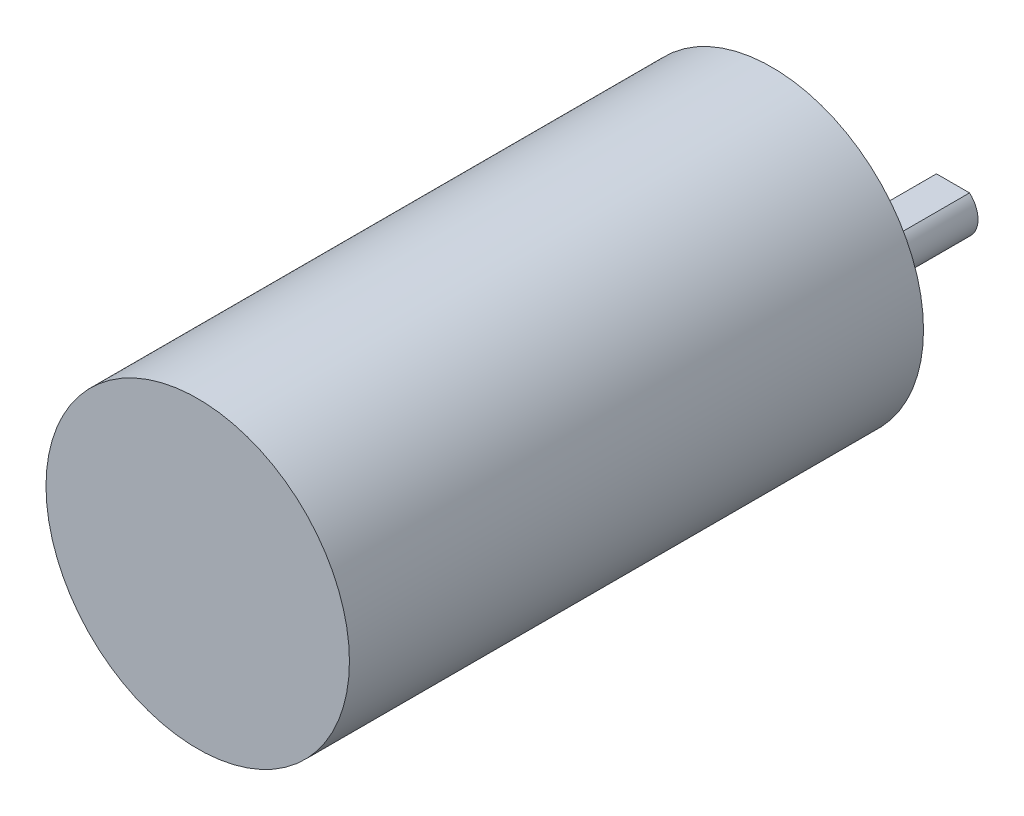
ISO-10303-21;
HEADER;
FILE_DESCRIPTION(('STEP AP214'),'2;1');
FILE_NAME('part.step','',(''),(''),'','','');
FILE_SCHEMA(('AUTOMOTIVE_DESIGN { 1 0 10303 214 1 1 1 1 }'));
ENDSEC;
DATA;
#1=APPLICATION_CONTEXT('core data for automotive mechanical design processes');
#2=APPLICATION_PROTOCOL_DEFINITION('international standard','automotive_design',2000,#1);
#3=PRODUCT_CONTEXT('',#1,'mechanical');
#4=PRODUCT('Part','Part','',(#3));
#5=PRODUCT_RELATED_PRODUCT_CATEGORY('part','',(#4));
#6=PRODUCT_DEFINITION_FORMATION('','',#4);
#7=PRODUCT_DEFINITION_CONTEXT('part definition',#1,'design');
#8=PRODUCT_DEFINITION('design','',#6,#7);
#9=PRODUCT_DEFINITION_SHAPE('','',#8);
#10=(LENGTH_UNIT() NAMED_UNIT(*) SI_UNIT(.MILLI.,.METRE.));
#11=(NAMED_UNIT(*) PLANE_ANGLE_UNIT() SI_UNIT($,.RADIAN.));
#12=(NAMED_UNIT(*) SI_UNIT($,.STERADIAN.) SOLID_ANGLE_UNIT());
#13=UNCERTAINTY_MEASURE_WITH_UNIT(LENGTH_MEASURE(1.E-05),#10,'distance_accuracy_value','');
#14=(GEOMETRIC_REPRESENTATION_CONTEXT(3) GLOBAL_UNCERTAINTY_ASSIGNED_CONTEXT((#13)) GLOBAL_UNIT_ASSIGNED_CONTEXT((#10,
#11,#12)) REPRESENTATION_CONTEXT('',''));
#15=CARTESIAN_POINT('',(0.,0.,0.));
#16=DIRECTION('',(0.,0.,1.));
#17=DIRECTION('',(1.,0.,0.));
#18=AXIS2_PLACEMENT_3D('',#15,#16,#17);
#19=CARTESIAN_POINT('',(0.,0.,70.));
#20=DIRECTION('',(0.,0.,-1.));
#21=DIRECTION('',(-1.,0.,0.));
#22=AXIS2_PLACEMENT_3D('',#19,#20,#21);
#23=CYLINDRICAL_SURFACE('',#22,18.5);
#24=CARTESIAN_POINT('',(0.,0.,70.));
#25=DIRECTION('',(0.,0.,1.));
#26=DIRECTION('',(1.,0.,0.));
#27=AXIS2_PLACEMENT_3D('',#24,#25,#26);
#28=CIRCLE('',#27,18.5);
#29=CARTESIAN_POINT('',(18.5,0.,70.));
#30=VERTEX_POINT('',#29);
#31=EDGE_CURVE('E85',#30,#30,#28,.T.);
#32=ORIENTED_EDGE('',*,*,#31,.F.);
#33=EDGE_LOOP('',(#32));
#34=FACE_BOUND('',#33,.T.);
#35=CARTESIAN_POINT('',(0.,0.,0.));
#36=DIRECTION('',(0.,0.,1.));
#37=DIRECTION('',(1.,0.,0.));
#38=AXIS2_PLACEMENT_3D('',#35,#36,#37);
#39=CIRCLE('',#38,18.5);
#40=CARTESIAN_POINT('',(18.5,0.,0.));
#41=VERTEX_POINT('',#40);
#42=EDGE_CURVE('E76',#41,#41,#39,.T.);
#43=ORIENTED_EDGE('',*,*,#42,.T.);
#44=EDGE_LOOP('',(#43));
#45=FACE_BOUND('',#44,.T.);
#46=ADVANCED_FACE('F34',(#34,#45),#23,.T.);
#47=CARTESIAN_POINT('',(0.,0.,70.));
#48=DIRECTION('',(0.,0.,1.));
#49=DIRECTION('',(1.,0.,0.));
#50=AXIS2_PLACEMENT_3D('',#47,#48,#49);
#51=PLANE('',#50);
#52=ORIENTED_EDGE('',*,*,#31,.T.);
#53=EDGE_LOOP('',(#52));
#54=FACE_BOUND('',#53,.T.);
#55=ADVANCED_FACE('F94',(#54),#51,.T.);
#56=CARTESIAN_POINT('',(0.,0.,0.));
#57=DIRECTION('',(0.,0.,1.));
#58=DIRECTION('',(1.,0.,0.));
#59=AXIS2_PLACEMENT_3D('',#56,#57,#58);
#60=PLANE('',#59);
#61=CARTESIAN_POINT('',(15.2766,0.,0.));
#62=DIRECTION('',(0.,0.,-1.));
#63=DIRECTION('',(-1.,0.,0.));
#64=AXIS2_PLACEMENT_3D('',#61,#62,#63);
#65=CIRCLE('',#64,1.6);
#66=CARTESIAN_POINT('',(13.6766,0.,0.));
#67=VERTEX_POINT('',#66);
#68=EDGE_CURVE('E79',#67,#67,#65,.T.);
#69=ORIENTED_EDGE('',*,*,#68,.F.);
#70=EDGE_LOOP('',(#69));
#71=FACE_BOUND('',#70,.T.);
#72=CARTESIAN_POINT('',(-7.79422931496333,13.2140965368011,0.));
#73=DIRECTION('',(0.,0.,-1.));
#74=DIRECTION('',(-1.,0.,0.));
#75=AXIS2_PLACEMENT_3D('',#72,#73,#74);
#76=CIRCLE('',#75,1.6);
#77=CARTESIAN_POINT('',(-9.39422931496333,13.2140965368011,0.));
#78=VERTEX_POINT('',#77);
#79=EDGE_CURVE('E292',#78,#78,#76,.T.);
#80=ORIENTED_EDGE('',*,*,#79,.F.);
#81=EDGE_LOOP('',(#80));
#82=FACE_BOUND('',#81,.T.);
#83=CARTESIAN_POINT('',(7.79422931496333,13.2140965368011,0.));
#84=DIRECTION('',(0.,0.,-1.));
#85=DIRECTION('',(-1.,0.,0.));
#86=AXIS2_PLACEMENT_3D('',#83,#84,#85);
#87=CIRCLE('',#86,1.6);
#88=CARTESIAN_POINT('',(6.19422931496333,13.2140965368011,0.));
#89=VERTEX_POINT('',#88);
#90=EDGE_CURVE('E82',#89,#89,#87,.T.);
#91=ORIENTED_EDGE('',*,*,#90,.F.);
#92=EDGE_LOOP('',(#91));
#93=FACE_BOUND('',#92,.T.);
#94=CARTESIAN_POINT('',(7.79422931496333,-13.5675408579338,0.));
#95=DIRECTION('',(0.,0.,-1.));
#96=DIRECTION('',(-1.,0.,0.));
#97=AXIS2_PLACEMENT_3D('',#94,#95,#96);
#98=CIRCLE('',#97,1.6);
#99=CARTESIAN_POINT('',(6.19422931496333,-13.5675408579338,0.));
#100=VERTEX_POINT('',#99);
#101=EDGE_CURVE('E318',#100,#100,#98,.T.);
#102=ORIENTED_EDGE('',*,*,#101,.F.);
#103=EDGE_LOOP('',(#102));
#104=FACE_BOUND('',#103,.T.);
#105=CARTESIAN_POINT('',(-7.79422931496334,-13.5675408579338,0.));
#106=DIRECTION('',(0.,0.,-1.));
#107=DIRECTION('',(-1.,0.,0.));
#108=AXIS2_PLACEMENT_3D('',#105,#106,#107);
#109=CIRCLE('',#108,1.6);
#110=CARTESIAN_POINT('',(-9.39422931496334,-13.5675408579338,0.));
#111=VERTEX_POINT('',#110);
#112=EDGE_CURVE('E312',#111,#111,#109,.T.);
#113=ORIENTED_EDGE('',*,*,#112,.F.);
#114=EDGE_LOOP('',(#113));
#115=FACE_BOUND('',#114,.T.);
#116=CARTESIAN_POINT('',(-15.2766,0.,0.));
#117=DIRECTION('',(0.,0.,-1.));
#118=DIRECTION('',(-1.,0.,0.));
#119=AXIS2_PLACEMENT_3D('',#116,#117,#118);
#120=CIRCLE('',#119,1.6);
#121=CARTESIAN_POINT('',(-16.8766,0.,0.));
#122=VERTEX_POINT('',#121);
#123=EDGE_CURVE('E306',#122,#122,#120,.T.);
#124=ORIENTED_EDGE('',*,*,#123,.F.);
#125=EDGE_LOOP('',(#124));
#126=FACE_BOUND('',#125,.T.);
#127=CARTESIAN_POINT('',(0.,-7.112,0.));
#128=DIRECTION('',(0.,0.,1.));
#129=DIRECTION('',(1.,0.,0.));
#130=AXIS2_PLACEMENT_3D('',#127,#128,#129);
#131=CIRCLE('',#130,5.969);
#132=CARTESIAN_POINT('',(5.969,-7.112,0.));
#133=VERTEX_POINT('',#132);
#134=EDGE_CURVE('E37',#133,#133,#131,.F.);
#135=ORIENTED_EDGE('',*,*,#134,.F.);
#136=EDGE_LOOP('',(#135));
#137=FACE_BOUND('',#136,.T.);
#138=ORIENTED_EDGE('',*,*,#42,.F.);
#139=EDGE_LOOP('',(#138));
#140=FACE_BOUND('',#139,.T.);
#141=ADVANCED_FACE('F91',(#71,#82,#93,#104,#115,#126,#137,#140),#60,.F.);
#142=CARTESIAN_POINT('',(0.,-7.112,-6.096));
#143=DIRECTION('',(0.,0.,1.));
#144=DIRECTION('',(1.,0.,0.));
#145=AXIS2_PLACEMENT_3D('',#142,#143,#144);
#146=CYLINDRICAL_SURFACE('',#145,5.969);
#147=CARTESIAN_POINT('',(0.,-7.112,-6.096));
#148=DIRECTION('',(0.,0.,-1.));
#149=DIRECTION('',(-1.,0.,0.));
#150=AXIS2_PLACEMENT_3D('',#147,#148,#149);
#151=CIRCLE('',#150,5.969);
#152=CARTESIAN_POINT('',(-5.969,-7.112,-6.096));
#153=VERTEX_POINT('',#152);
#154=EDGE_CURVE('E72',#153,#153,#151,.T.);
#155=ORIENTED_EDGE('',*,*,#154,.F.);
#156=EDGE_LOOP('',(#155));
#157=FACE_BOUND('',#156,.T.);
#158=ORIENTED_EDGE('',*,*,#134,.T.);
#159=EDGE_LOOP('',(#158));
#160=FACE_BOUND('',#159,.T.);
#161=ADVANCED_FACE('F93',(#157,#160),#146,.T.);
#162=CARTESIAN_POINT('',(0.,-7.112,-6.096));
#163=DIRECTION('',(0.,0.,-1.));
#164=DIRECTION('',(-1.,0.,0.));
#165=AXIS2_PLACEMENT_3D('',#162,#163,#164);
#166=PLANE('',#165);
#167=CARTESIAN_POINT('',(0.,-7.112,-6.096));
#168=DIRECTION('',(0.,0.,-1.));
#169=DIRECTION('',(-1.,0.,0.));
#170=AXIS2_PLACEMENT_3D('',#167,#168,#169);
#171=CIRCLE('',#170,3.048);
#172=CARTESIAN_POINT('',(2.01606249903122,-4.826,-6.096));
#173=VERTEX_POINT('',#172);
#174=CARTESIAN_POINT('',(-2.01606249903122,-4.826,-6.096));
#175=VERTEX_POINT('',#174);
#176=EDGE_CURVE('E11',#173,#175,#171,.T.);
#177=ORIENTED_EDGE('',*,*,#176,.F.);
#178=DIRECTION('',(1.,0.,0.));
#179=VECTOR('',#178,1.);
#180=CARTESIAN_POINT('',(2.01606249903122,-4.826,-6.096));
#181=LINE('',#180,#179);
#182=EDGE_CURVE('E54',#175,#173,#181,.T.);
#183=ORIENTED_EDGE('',*,*,#182,.F.);
#184=EDGE_LOOP('',(#177,#183));
#185=FACE_BOUND('',#184,.T.);
#186=ORIENTED_EDGE('',*,*,#154,.T.);
#187=EDGE_LOOP('',(#186));
#188=FACE_BOUND('',#187,.T.);
#189=ADVANCED_FACE('F100',(#185,#188),#166,.T.);
#190=CARTESIAN_POINT('',(0.,-7.112,-22.098));
#191=DIRECTION('',(0.,0.,1.));
#192=DIRECTION('',(1.,0.,0.));
#193=AXIS2_PLACEMENT_3D('',#190,#191,#192);
#194=CYLINDRICAL_SURFACE('',#193,3.048);
#195=CARTESIAN_POINT('',(0.,-7.112,-22.098));
#196=DIRECTION('',(0.,0.,-1.));
#197=DIRECTION('',(-1.,0.,0.));
#198=AXIS2_PLACEMENT_3D('',#195,#196,#197);
#199=CIRCLE('',#198,3.048);
#200=CARTESIAN_POINT('',(2.01606249903122,-4.826,-22.098));
#201=VERTEX_POINT('',#200);
#202=CARTESIAN_POINT('',(-2.01606249903122,-4.826,-22.098));
#203=VERTEX_POINT('',#202);
#204=EDGE_CURVE('E68',#201,#203,#199,.T.);
#205=ORIENTED_EDGE('',*,*,#204,.F.);
#206=DIRECTION('',(0.,0.,-1.));
#207=VECTOR('',#206,1.);
#208=CARTESIAN_POINT('',(2.01606249903122,-4.826,-1.99250441696351));
#209=LINE('',#208,#207);
#210=EDGE_CURVE('E49',#173,#201,#209,.T.);
#211=ORIENTED_EDGE('',*,*,#210,.F.);
#212=ORIENTED_EDGE('',*,*,#176,.T.);
#213=DIRECTION('',(0.,0.,-1.));
#214=VECTOR('',#213,1.);
#215=CARTESIAN_POINT('',(-2.01606249903122,-4.826,-1.99250441696351));
#216=LINE('',#215,#214);
#217=EDGE_CURVE('E61',#175,#203,#216,.T.);
#218=ORIENTED_EDGE('',*,*,#217,.T.);
#219=EDGE_LOOP('',(#205,#211,#212,#218));
#220=FACE_BOUND('',#219,.T.);
#221=ADVANCED_FACE('F67',(#220),#194,.T.);
#222=CARTESIAN_POINT('',(0.,-7.112,-22.098));
#223=DIRECTION('',(0.,0.,-1.));
#224=DIRECTION('',(-1.,0.,0.));
#225=AXIS2_PLACEMENT_3D('',#222,#223,#224);
#226=PLANE('',#225);
#227=DIRECTION('',(-1.,0.,0.));
#228=VECTOR('',#227,1.);
#229=CARTESIAN_POINT('',(2.01606249903122,-4.826,-22.098));
#230=LINE('',#229,#228);
#231=EDGE_CURVE('E58',#201,#203,#230,.T.);
#232=ORIENTED_EDGE('',*,*,#231,.F.);
#233=ORIENTED_EDGE('',*,*,#204,.T.);
#234=EDGE_LOOP('',(#232,#233));
#235=FACE_BOUND('',#234,.T.);
#236=ADVANCED_FACE('F71',(#235),#226,.T.);
#237=CARTESIAN_POINT('',(-15.2766,0.,3.));
#238=DIRECTION('',(0.,0.,-1.));
#239=DIRECTION('',(-1.,0.,0.));
#240=AXIS2_PLACEMENT_3D('',#237,#238,#239);
#241=CYLINDRICAL_SURFACE('',#240,1.6);
#242=CARTESIAN_POINT('',(-15.2766,0.,3.));
#243=DIRECTION('',(0.,0.,-1.));
#244=DIRECTION('',(-1.,0.,0.));
#245=AXIS2_PLACEMENT_3D('',#242,#243,#244);
#246=CIRCLE('',#245,1.6);
#247=CARTESIAN_POINT('',(-16.8766,0.,3.));
#248=VERTEX_POINT('',#247);
#249=EDGE_CURVE('E301',#248,#248,#246,.T.);
#250=ORIENTED_EDGE('',*,*,#249,.F.);
#251=EDGE_LOOP('',(#250));
#252=FACE_BOUND('',#251,.T.);
#253=ORIENTED_EDGE('',*,*,#123,.T.);
#254=EDGE_LOOP('',(#253));
#255=FACE_BOUND('',#254,.T.);
#256=ADVANCED_FACE('F133',(#252,#255),#241,.F.);
#257=CARTESIAN_POINT('',(-15.2766,0.,3.));
#258=DIRECTION('',(0.,0.,-1.));
#259=DIRECTION('',(-1.,0.,0.));
#260=AXIS2_PLACEMENT_3D('',#257,#258,#259);
#261=PLANE('',#260);
#262=ORIENTED_EDGE('',*,*,#249,.T.);
#263=EDGE_LOOP('',(#262));
#264=FACE_BOUND('',#263,.T.);
#265=ADVANCED_FACE('F138',(#264),#261,.T.);
#266=CARTESIAN_POINT('',(-7.79422931496334,-13.5675408579338,3.));
#267=DIRECTION('',(0.,0.,-1.));
#268=DIRECTION('',(-1.,0.,0.));
#269=AXIS2_PLACEMENT_3D('',#266,#267,#268);
#270=CYLINDRICAL_SURFACE('',#269,1.6);
#271=CARTESIAN_POINT('',(-7.79422931496334,-13.5675408579338,3.));
#272=DIRECTION('',(0.,0.,-1.));
#273=DIRECTION('',(-1.,0.,0.));
#274=AXIS2_PLACEMENT_3D('',#271,#272,#273);
#275=CIRCLE('',#274,1.6);
#276=CARTESIAN_POINT('',(-9.39422931496334,-13.5675408579338,3.));
#277=VERTEX_POINT('',#276);
#278=EDGE_CURVE('E309',#277,#277,#275,.T.);
#279=ORIENTED_EDGE('',*,*,#278,.F.);
#280=EDGE_LOOP('',(#279));
#281=FACE_BOUND('',#280,.T.);
#282=ORIENTED_EDGE('',*,*,#112,.T.);
#283=EDGE_LOOP('',(#282));
#284=FACE_BOUND('',#283,.T.);
#285=ADVANCED_FACE('F150',(#281,#284),#270,.F.);
#286=CARTESIAN_POINT('',(-7.79422931496334,-13.5675408579338,3.));
#287=DIRECTION('',(0.,0.,-1.));
#288=DIRECTION('',(-1.,0.,0.));
#289=AXIS2_PLACEMENT_3D('',#286,#287,#288);
#290=PLANE('',#289);
#291=ORIENTED_EDGE('',*,*,#278,.T.);
#292=EDGE_LOOP('',(#291));
#293=FACE_BOUND('',#292,.T.);
#294=ADVANCED_FACE('F160',(#293),#290,.T.);
#295=CARTESIAN_POINT('',(7.79422931496333,-13.5675408579338,3.));
#296=DIRECTION('',(0.,0.,-1.));
#297=DIRECTION('',(-1.,0.,0.));
#298=AXIS2_PLACEMENT_3D('',#295,#296,#297);
#299=CYLINDRICAL_SURFACE('',#298,1.6);
#300=CARTESIAN_POINT('',(7.79422931496333,-13.5675408579338,3.));
#301=DIRECTION('',(0.,0.,-1.));
#302=DIRECTION('',(-1.,0.,0.));
#303=AXIS2_PLACEMENT_3D('',#300,#301,#302);
#304=CIRCLE('',#303,1.6);
#305=CARTESIAN_POINT('',(6.19422931496333,-13.5675408579338,3.));
#306=VERTEX_POINT('',#305);
#307=EDGE_CURVE('E315',#306,#306,#304,.T.);
#308=ORIENTED_EDGE('',*,*,#307,.F.);
#309=EDGE_LOOP('',(#308));
#310=FACE_BOUND('',#309,.T.);
#311=ORIENTED_EDGE('',*,*,#101,.T.);
#312=EDGE_LOOP('',(#311));
#313=FACE_BOUND('',#312,.T.);
#314=ADVANCED_FACE('F170',(#310,#313),#299,.F.);
#315=CARTESIAN_POINT('',(7.79422931496333,-13.5675408579338,3.));
#316=DIRECTION('',(0.,0.,-1.));
#317=DIRECTION('',(-1.,0.,0.));
#318=AXIS2_PLACEMENT_3D('',#315,#316,#317);
#319=PLANE('',#318);
#320=ORIENTED_EDGE('',*,*,#307,.T.);
#321=EDGE_LOOP('',(#320));
#322=FACE_BOUND('',#321,.T.);
#323=ADVANCED_FACE('F180',(#322),#319,.T.);
#324=CARTESIAN_POINT('',(7.79422931496333,13.2140965368011,3.));
#325=DIRECTION('',(0.,0.,-1.));
#326=DIRECTION('',(-1.,0.,0.));
#327=AXIS2_PLACEMENT_3D('',#324,#325,#326);
#328=CYLINDRICAL_SURFACE('',#327,1.6);
#329=CARTESIAN_POINT('',(7.79422931496333,13.2140965368011,3.));
#330=DIRECTION('',(0.,0.,-1.));
#331=DIRECTION('',(-1.,0.,0.));
#332=AXIS2_PLACEMENT_3D('',#329,#330,#331);
#333=CIRCLE('',#332,1.6);
#334=CARTESIAN_POINT('',(6.19422931496333,13.2140965368011,3.));
#335=VERTEX_POINT('',#334);
#336=EDGE_CURVE('E320',#335,#335,#333,.T.);
#337=ORIENTED_EDGE('',*,*,#336,.F.);
#338=EDGE_LOOP('',(#337));
#339=FACE_BOUND('',#338,.T.);
#340=ORIENTED_EDGE('',*,*,#90,.T.);
#341=EDGE_LOOP('',(#340));
#342=FACE_BOUND('',#341,.T.);
#343=ADVANCED_FACE('F190',(#339,#342),#328,.F.);
#344=CARTESIAN_POINT('',(7.79422931496333,13.2140965368011,3.));
#345=DIRECTION('',(0.,0.,-1.));
#346=DIRECTION('',(-1.,0.,0.));
#347=AXIS2_PLACEMENT_3D('',#344,#345,#346);
#348=PLANE('',#347);
#349=ORIENTED_EDGE('',*,*,#336,.T.);
#350=EDGE_LOOP('',(#349));
#351=FACE_BOUND('',#350,.T.);
#352=ADVANCED_FACE('F200',(#351),#348,.T.);
#353=CARTESIAN_POINT('',(-7.79422931496333,13.2140965368011,3.));
#354=DIRECTION('',(0.,0.,-1.));
#355=DIRECTION('',(-1.,0.,0.));
#356=AXIS2_PLACEMENT_3D('',#353,#354,#355);
#357=CYLINDRICAL_SURFACE('',#356,1.6);
#358=CARTESIAN_POINT('',(-7.79422931496333,13.2140965368011,3.));
#359=DIRECTION('',(0.,0.,-1.));
#360=DIRECTION('',(-1.,0.,0.));
#361=AXIS2_PLACEMENT_3D('',#358,#359,#360);
#362=CIRCLE('',#361,1.6);
#363=CARTESIAN_POINT('',(-9.39422931496333,13.2140965368011,3.));
#364=VERTEX_POINT('',#363);
#365=EDGE_CURVE('E295',#364,#364,#362,.T.);
#366=ORIENTED_EDGE('',*,*,#365,.F.);
#367=EDGE_LOOP('',(#366));
#368=FACE_BOUND('',#367,.T.);
#369=ORIENTED_EDGE('',*,*,#79,.T.);
#370=EDGE_LOOP('',(#369));
#371=FACE_BOUND('',#370,.T.);
#372=ADVANCED_FACE('F210',(#368,#371),#357,.F.);
#373=CARTESIAN_POINT('',(-7.79422931496333,13.2140965368011,3.));
#374=DIRECTION('',(0.,0.,-1.));
#375=DIRECTION('',(-1.,0.,0.));
#376=AXIS2_PLACEMENT_3D('',#373,#374,#375);
#377=PLANE('',#376);
#378=ORIENTED_EDGE('',*,*,#365,.T.);
#379=EDGE_LOOP('',(#378));
#380=FACE_BOUND('',#379,.T.);
#381=ADVANCED_FACE('F220',(#380),#377,.T.);
#382=CARTESIAN_POINT('',(15.2766,0.,3.));
#383=DIRECTION('',(0.,0.,-1.));
#384=DIRECTION('',(-1.,0.,0.));
#385=AXIS2_PLACEMENT_3D('',#382,#383,#384);
#386=CYLINDRICAL_SURFACE('',#385,1.6);
#387=CARTESIAN_POINT('',(15.2766,0.,3.));
#388=DIRECTION('',(0.,0.,-1.));
#389=DIRECTION('',(-1.,0.,0.));
#390=AXIS2_PLACEMENT_3D('',#387,#388,#389);
#391=CIRCLE('',#390,1.6);
#392=CARTESIAN_POINT('',(13.6766,0.,3.));
#393=VERTEX_POINT('',#392);
#394=EDGE_CURVE('E73',#393,#393,#391,.T.);
#395=ORIENTED_EDGE('',*,*,#394,.F.);
#396=EDGE_LOOP('',(#395));
#397=FACE_BOUND('',#396,.T.);
#398=ORIENTED_EDGE('',*,*,#68,.T.);
#399=EDGE_LOOP('',(#398));
#400=FACE_BOUND('',#399,.T.);
#401=ADVANCED_FACE('F230',(#397,#400),#386,.F.);
#402=CARTESIAN_POINT('',(15.2766,0.,3.));
#403=DIRECTION('',(0.,0.,-1.));
#404=DIRECTION('',(-1.,0.,0.));
#405=AXIS2_PLACEMENT_3D('',#402,#403,#404);
#406=PLANE('',#405);
#407=ORIENTED_EDGE('',*,*,#394,.T.);
#408=EDGE_LOOP('',(#407));
#409=FACE_BOUND('',#408,.T.);
#410=ADVANCED_FACE('F240',(#409),#406,.T.);
#411=CARTESIAN_POINT('',(2.01606249903122,-4.826,-1.99250441696351));
#412=DIRECTION('',(0.,-1.,0.));
#413=DIRECTION('',(0.,0.,-1.));
#414=AXIS2_PLACEMENT_3D('',#411,#412,#413);
#415=PLANE('',#414);
#416=ORIENTED_EDGE('',*,*,#182,.T.);
#417=ORIENTED_EDGE('',*,*,#210,.T.);
#418=ORIENTED_EDGE('',*,*,#231,.T.);
#419=ORIENTED_EDGE('',*,*,#217,.F.);
#420=EDGE_LOOP('',(#416,#417,#418,#419));
#421=FACE_BOUND('',#420,.T.);
#422=ADVANCED_FACE('F60',(#421),#415,.F.);
#423=CLOSED_SHELL('',(#46,#55,#141,#161,#189,#221,#236,#256,#265,#285,#294,#314,#323,#343,#352,
#372,#381,#401,#410,#422));
#424=MANIFOLD_SOLID_BREP('B2',#423);
#425=ADVANCED_BREP_SHAPE_REPRESENTATION('',(#18,#424),#14);
#426=SHAPE_DEFINITION_REPRESENTATION(#9,#425);
ENDSEC;
END-ISO-10303-21;
